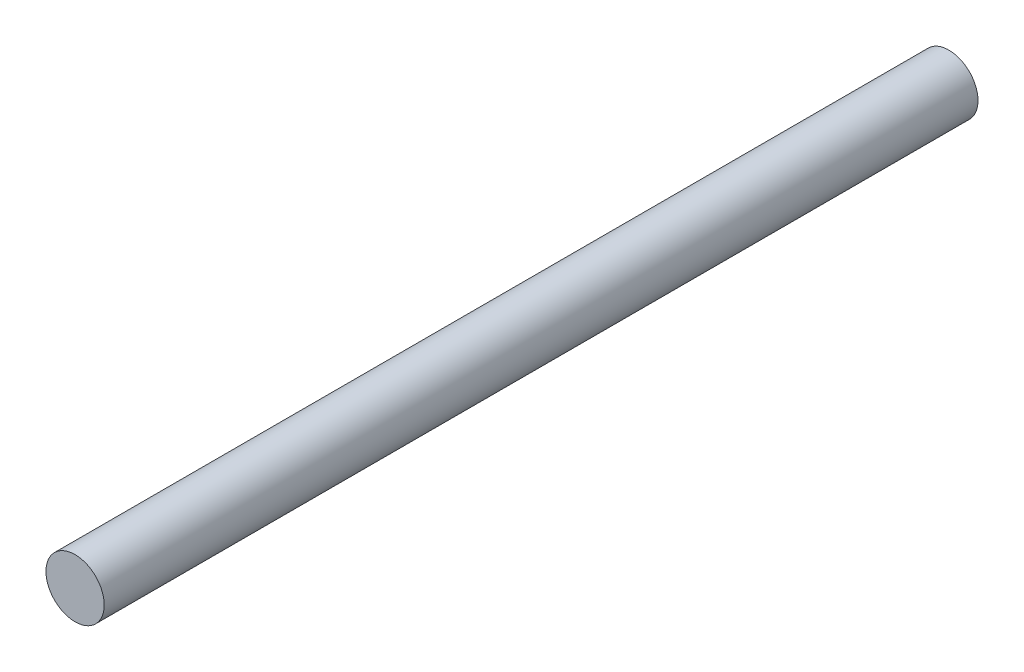
ISO-10303-21;
HEADER;
FILE_DESCRIPTION(('STEP AP214'),'2;1');
FILE_NAME('part.step','',(''),(''),'','','');
FILE_SCHEMA(('AUTOMOTIVE_DESIGN { 1 0 10303 214 1 1 1 1 }'));
ENDSEC;
DATA;
#1=APPLICATION_CONTEXT('core data for automotive mechanical design processes');
#2=APPLICATION_PROTOCOL_DEFINITION('international standard','automotive_design',2000,#1);
#3=PRODUCT_CONTEXT('',#1,'mechanical');
#4=PRODUCT('Part','Part','',(#3));
#5=PRODUCT_RELATED_PRODUCT_CATEGORY('part','',(#4));
#6=PRODUCT_DEFINITION_FORMATION('','',#4);
#7=PRODUCT_DEFINITION_CONTEXT('part definition',#1,'design');
#8=PRODUCT_DEFINITION('design','',#6,#7);
#9=PRODUCT_DEFINITION_SHAPE('','',#8);
#10=(LENGTH_UNIT() NAMED_UNIT(*) SI_UNIT(.MILLI.,.METRE.));
#11=(NAMED_UNIT(*) PLANE_ANGLE_UNIT() SI_UNIT($,.RADIAN.));
#12=(NAMED_UNIT(*) SI_UNIT($,.STERADIAN.) SOLID_ANGLE_UNIT());
#13=UNCERTAINTY_MEASURE_WITH_UNIT(LENGTH_MEASURE(1.E-05),#10,'distance_accuracy_value','');
#14=(GEOMETRIC_REPRESENTATION_CONTEXT(3) GLOBAL_UNCERTAINTY_ASSIGNED_CONTEXT((#13)) GLOBAL_UNIT_ASSIGNED_CONTEXT((#10,
#11,#12)) REPRESENTATION_CONTEXT('',''));
#15=CARTESIAN_POINT('',(0.,0.,0.));
#16=DIRECTION('',(0.,0.,1.));
#17=DIRECTION('',(1.,0.,0.));
#18=AXIS2_PLACEMENT_3D('',#15,#16,#17);
#19=CARTESIAN_POINT('',(0.,0.,150.));
#20=DIRECTION('',(0.,0.,-1.));
#21=DIRECTION('',(-1.,0.,0.));
#22=AXIS2_PLACEMENT_3D('',#19,#20,#21);
#23=CYLINDRICAL_SURFACE('',#22,5.);
#24=CARTESIAN_POINT('',(0.,0.,150.));
#25=DIRECTION('',(0.,0.,1.));
#26=DIRECTION('',(1.,0.,0.));
#27=AXIS2_PLACEMENT_3D('',#24,#25,#26);
#28=CIRCLE('',#27,5.);
#29=CARTESIAN_POINT('',(5.,0.,150.));
#30=VERTEX_POINT('',#29);
#31=EDGE_CURVE('E10',#30,#30,#28,.T.);
#32=ORIENTED_EDGE('',*,*,#31,.F.);
#33=EDGE_LOOP('',(#32));
#34=FACE_BOUND('',#33,.T.);
#35=CARTESIAN_POINT('',(0.,0.,0.));
#36=DIRECTION('',(0.,0.,1.));
#37=DIRECTION('',(1.,0.,0.));
#38=AXIS2_PLACEMENT_3D('',#35,#36,#37);
#39=CIRCLE('',#38,5.);
#40=CARTESIAN_POINT('',(5.,0.,0.));
#41=VERTEX_POINT('',#40);
#42=EDGE_CURVE('E32',#41,#41,#39,.T.);
#43=ORIENTED_EDGE('',*,*,#42,.T.);
#44=EDGE_LOOP('',(#43));
#45=FACE_BOUND('',#44,.T.);
#46=ADVANCED_FACE('F29',(#34,#45),#23,.T.);
#47=CARTESIAN_POINT('',(0.,0.,150.));
#48=DIRECTION('',(0.,0.,1.));
#49=DIRECTION('',(1.,0.,0.));
#50=AXIS2_PLACEMENT_3D('',#47,#48,#49);
#51=PLANE('',#50);
#52=ORIENTED_EDGE('',*,*,#31,.T.);
#53=EDGE_LOOP('',(#52));
#54=FACE_BOUND('',#53,.T.);
#55=ADVANCED_FACE('F44',(#54),#51,.T.);
#56=CARTESIAN_POINT('',(0.,0.,0.));
#57=DIRECTION('',(0.,0.,1.));
#58=DIRECTION('',(1.,0.,0.));
#59=AXIS2_PLACEMENT_3D('',#56,#57,#58);
#60=PLANE('',#59);
#61=ORIENTED_EDGE('',*,*,#42,.F.);
#62=EDGE_LOOP('',(#61));
#63=FACE_BOUND('',#62,.T.);
#64=ADVANCED_FACE('F42',(#63),#60,.F.);
#65=CLOSED_SHELL('',(#46,#55,#64));
#66=MANIFOLD_SOLID_BREP('B2',#65);
#67=ADVANCED_BREP_SHAPE_REPRESENTATION('',(#18,#66),#14);
#68=SHAPE_DEFINITION_REPRESENTATION(#9,#67);
ENDSEC;
END-ISO-10303-21;
